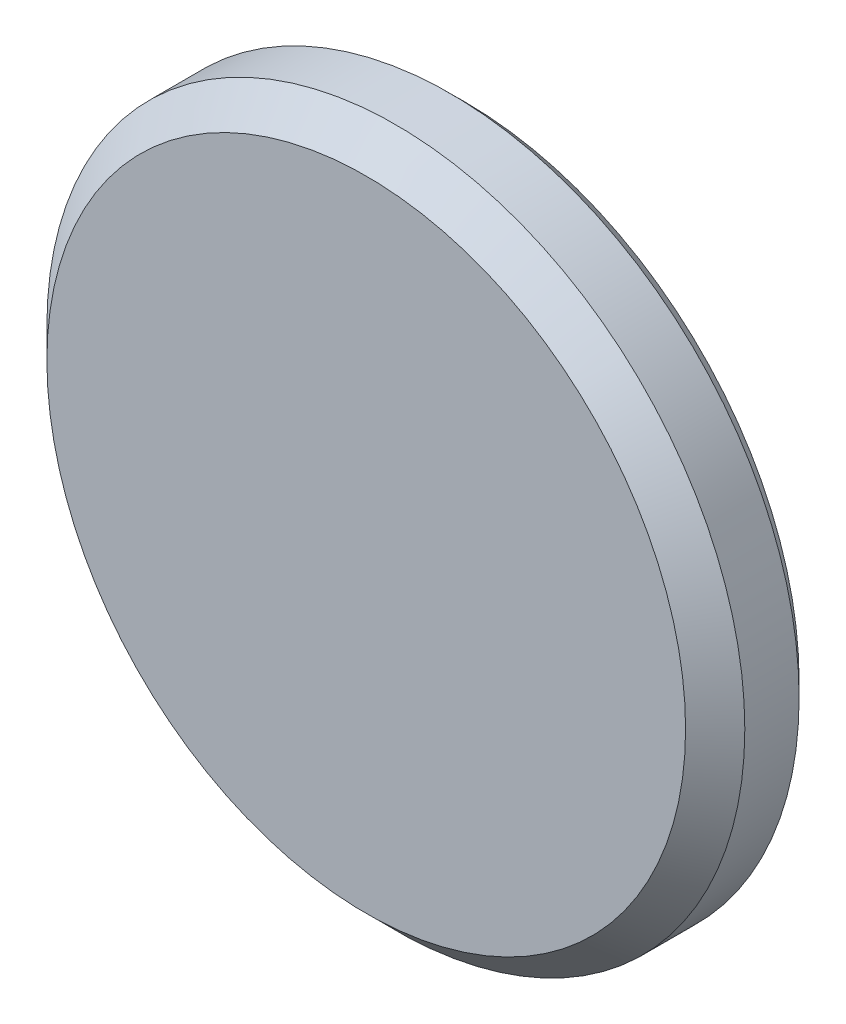
ISO-10303-21;
HEADER;
FILE_DESCRIPTION(('STEP AP214'),'2;1');
FILE_NAME('part.step','',(''),(''),'','','');
FILE_SCHEMA(('AUTOMOTIVE_DESIGN { 1 0 10303 214 1 1 1 1 }'));
ENDSEC;
DATA;
#1=APPLICATION_CONTEXT('core data for automotive mechanical design processes');
#2=APPLICATION_PROTOCOL_DEFINITION('international standard','automotive_design',2000,#1);
#3=PRODUCT_CONTEXT('',#1,'mechanical');
#4=PRODUCT('Part','Part','',(#3));
#5=PRODUCT_RELATED_PRODUCT_CATEGORY('part','',(#4));
#6=PRODUCT_DEFINITION_FORMATION('','',#4);
#7=PRODUCT_DEFINITION_CONTEXT('part definition',#1,'design');
#8=PRODUCT_DEFINITION('design','',#6,#7);
#9=PRODUCT_DEFINITION_SHAPE('','',#8);
#10=(LENGTH_UNIT() NAMED_UNIT(*) SI_UNIT(.MILLI.,.METRE.));
#11=(NAMED_UNIT(*) PLANE_ANGLE_UNIT() SI_UNIT($,.RADIAN.));
#12=(NAMED_UNIT(*) SI_UNIT($,.STERADIAN.) SOLID_ANGLE_UNIT());
#13=UNCERTAINTY_MEASURE_WITH_UNIT(LENGTH_MEASURE(1.E-05),#10,'distance_accuracy_value','');
#14=(GEOMETRIC_REPRESENTATION_CONTEXT(3) GLOBAL_UNCERTAINTY_ASSIGNED_CONTEXT((#13)) GLOBAL_UNIT_ASSIGNED_CONTEXT((#10,
#11,#12)) REPRESENTATION_CONTEXT('',''));
#15=CARTESIAN_POINT('',(0.,0.,0.));
#16=DIRECTION('',(0.,0.,1.));
#17=DIRECTION('',(1.,0.,0.));
#18=AXIS2_PLACEMENT_3D('',#15,#16,#17);
#19=CARTESIAN_POINT('',(0.,0.,2.54));
#20=DIRECTION('',(0.,0.,1.));
#21=DIRECTION('',(1.,0.,0.));
#22=AXIS2_PLACEMENT_3D('',#19,#20,#21);
#23=PLANE('',#22);
#24=CARTESIAN_POINT('',(0.,0.,2.54));
#25=DIRECTION('',(0.,0.,-1.));
#26=DIRECTION('',(-1.,0.,0.));
#27=AXIS2_PLACEMENT_3D('',#24,#25,#26);
#28=CIRCLE('',#27,8.2169);
#29=CARTESIAN_POINT('',(-8.2169,0.,2.54));
#30=VERTEX_POINT('',#29);
#31=EDGE_CURVE('E17',#30,#30,#28,.T.);
#32=ORIENTED_EDGE('',*,*,#31,.F.);
#33=EDGE_LOOP('',(#32));
#34=FACE_BOUND('',#33,.T.);
#35=ADVANCED_FACE('F14',(#34),#23,.T.);
#36=CARTESIAN_POINT('',(0.,0.,1.778));
#37=DIRECTION('',(0.,0.,-1.));
#38=DIRECTION('',(-1.,0.,0.));
#39=AXIS2_PLACEMENT_3D('',#36,#37,#38);
#40=CONICAL_SURFACE('',#39,8.9789,0.785398163397446);
#41=ORIENTED_EDGE('',*,*,#31,.T.);
#42=EDGE_LOOP('',(#41));
#43=FACE_BOUND('',#42,.T.);
#44=CARTESIAN_POINT('',(0.,0.,1.778));
#45=DIRECTION('',(0.,0.,-1.));
#46=DIRECTION('',(-1.,0.,0.));
#47=AXIS2_PLACEMENT_3D('',#44,#45,#46);
#48=CIRCLE('',#47,8.9789);
#49=CARTESIAN_POINT('',(-8.9789,0.,1.778));
#50=VERTEX_POINT('',#49);
#51=EDGE_CURVE('E25',#50,#50,#48,.T.);
#52=ORIENTED_EDGE('',*,*,#51,.F.);
#53=EDGE_LOOP('',(#52));
#54=FACE_BOUND('',#53,.T.);
#55=ADVANCED_FACE('F34',(#43,#54),#40,.T.);
#56=CARTESIAN_POINT('',(0.,0.,2.54));
#57=DIRECTION('',(0.,0.,-1.));
#58=DIRECTION('',(-1.,0.,0.));
#59=AXIS2_PLACEMENT_3D('',#56,#57,#58);
#60=CYLINDRICAL_SURFACE('',#59,8.9789);
#61=ORIENTED_EDGE('',*,*,#51,.T.);
#62=EDGE_LOOP('',(#61));
#63=FACE_BOUND('',#62,.T.);
#64=CARTESIAN_POINT('',(0.,0.,0.380999999999999));
#65=DIRECTION('',(0.,0.,1.));
#66=DIRECTION('',(1.,0.,0.));
#67=AXIS2_PLACEMENT_3D('',#64,#65,#66);
#68=CIRCLE('',#67,8.9789);
#69=CARTESIAN_POINT('',(8.9789,0.,0.380999999999999));
#70=VERTEX_POINT('',#69);
#71=EDGE_CURVE('E21',#70,#70,#68,.F.);
#72=ORIENTED_EDGE('',*,*,#71,.F.);
#73=EDGE_LOOP('',(#72));
#74=FACE_BOUND('',#73,.T.);
#75=ADVANCED_FACE('F42',(#63,#74),#60,.T.);
#76=CARTESIAN_POINT('',(0.,0.,0.380999999999999));
#77=DIRECTION('',(0.,0.,1.));
#78=DIRECTION('',(1.,0.,0.));
#79=AXIS2_PLACEMENT_3D('',#76,#77,#78);
#80=CONICAL_SURFACE('',#79,8.9789,0.785398163397451);
#81=CARTESIAN_POINT('',(0.,0.,0.));
#82=DIRECTION('',(0.,0.,1.));
#83=DIRECTION('',(1.,0.,0.));
#84=AXIS2_PLACEMENT_3D('',#81,#82,#83);
#85=CIRCLE('',#84,8.5979);
#86=CARTESIAN_POINT('',(8.5979,0.,0.));
#87=VERTEX_POINT('',#86);
#88=EDGE_CURVE('E10',#87,#87,#85,.T.);
#89=ORIENTED_EDGE('',*,*,#88,.T.);
#90=EDGE_LOOP('',(#89));
#91=FACE_BOUND('',#90,.T.);
#92=ORIENTED_EDGE('',*,*,#71,.T.);
#93=EDGE_LOOP('',(#92));
#94=FACE_BOUND('',#93,.T.);
#95=ADVANCED_FACE('F45',(#91,#94),#80,.T.);
#96=CARTESIAN_POINT('',(0.,0.,0.));
#97=DIRECTION('',(0.,0.,1.));
#98=DIRECTION('',(1.,0.,0.));
#99=AXIS2_PLACEMENT_3D('',#96,#97,#98);
#100=PLANE('',#99);
#101=ORIENTED_EDGE('',*,*,#88,.F.);
#102=EDGE_LOOP('',(#101));
#103=FACE_BOUND('',#102,.T.);
#104=ADVANCED_FACE('F43',(#103),#100,.F.);
#105=CLOSED_SHELL('',(#35,#55,#75,#95,#104));
#106=MANIFOLD_SOLID_BREP('B1',#105);
#107=ADVANCED_BREP_SHAPE_REPRESENTATION('',(#18,#106),#14);
#108=SHAPE_DEFINITION_REPRESENTATION(#9,#107);
ENDSEC;
END-ISO-10303-21;
